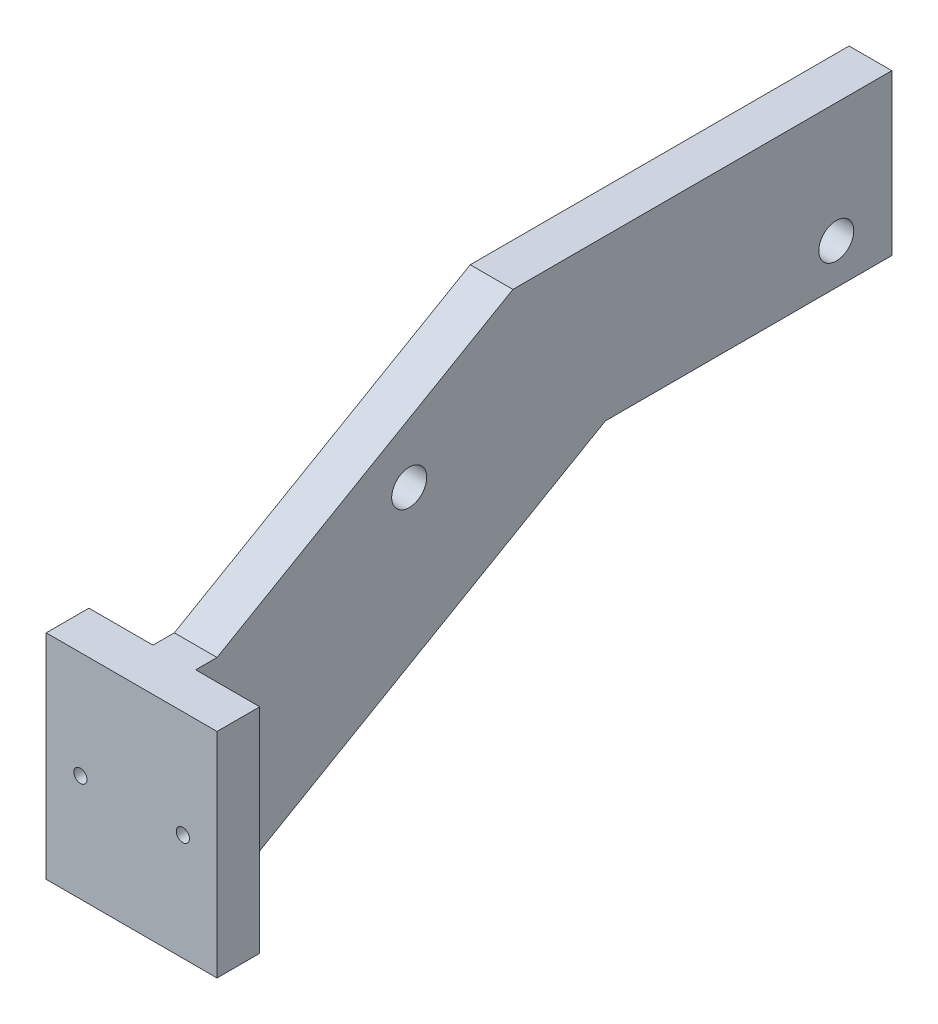
ISO-10303-21;
HEADER;
FILE_DESCRIPTION(('STEP AP214'),'2;1');
FILE_NAME('part.step','',(''),(''),'','','');
FILE_SCHEMA(('AUTOMOTIVE_DESIGN { 1 0 10303 214 1 1 1 1 }'));
ENDSEC;
DATA;
#1=APPLICATION_CONTEXT('core data for automotive mechanical design processes');
#2=APPLICATION_PROTOCOL_DEFINITION('international standard','automotive_design',2000,#1);
#3=PRODUCT_CONTEXT('',#1,'mechanical');
#4=PRODUCT('Part','Part','',(#3));
#5=PRODUCT_RELATED_PRODUCT_CATEGORY('part','',(#4));
#6=PRODUCT_DEFINITION_FORMATION('','',#4);
#7=PRODUCT_DEFINITION_CONTEXT('part definition',#1,'design');
#8=PRODUCT_DEFINITION('design','',#6,#7);
#9=PRODUCT_DEFINITION_SHAPE('','',#8);
#10=(LENGTH_UNIT() NAMED_UNIT(*) SI_UNIT(.MILLI.,.METRE.));
#11=(NAMED_UNIT(*) PLANE_ANGLE_UNIT() SI_UNIT($,.RADIAN.));
#12=(NAMED_UNIT(*) SI_UNIT($,.STERADIAN.) SOLID_ANGLE_UNIT());
#13=UNCERTAINTY_MEASURE_WITH_UNIT(LENGTH_MEASURE(1.E-05),#10,'distance_accuracy_value','');
#14=(GEOMETRIC_REPRESENTATION_CONTEXT(3) GLOBAL_UNCERTAINTY_ASSIGNED_CONTEXT((#13)) GLOBAL_UNIT_ASSIGNED_CONTEXT((#10,
#11,#12)) REPRESENTATION_CONTEXT('',''));
#15=CARTESIAN_POINT('',(0.,0.,0.));
#16=DIRECTION('',(0.,0.,1.));
#17=DIRECTION('',(1.,0.,0.));
#18=AXIS2_PLACEMENT_3D('',#15,#16,#17);
#19=CARTESIAN_POINT('',(10.,0.,0.));
#20=DIRECTION('',(-1.,0.,0.));
#21=DIRECTION('',(0.,0.,1.));
#22=AXIS2_PLACEMENT_3D('',#19,#20,#21);
#23=PLANE('',#22);
#24=CARTESIAN_POINT('',(10.,62.,-160.));
#25=DIRECTION('',(1.,0.,0.));
#26=DIRECTION('',(0.,0.,-1.));
#27=AXIS2_PLACEMENT_3D('',#24,#25,#26);
#28=CIRCLE('',#27,4.09999999999998);
#29=CARTESIAN_POINT('',(10.,62.,-164.1));
#30=VERTEX_POINT('',#29);
#31=EDGE_CURVE('E301',#30,#30,#28,.T.);
#32=ORIENTED_EDGE('',*,*,#31,.F.);
#33=EDGE_LOOP('',(#32));
#34=FACE_BOUND('',#33,.T.);
#35=CARTESIAN_POINT('',(10.,62.,-60.));
#36=DIRECTION('',(1.,0.,0.));
#37=DIRECTION('',(0.,0.,-1.));
#38=AXIS2_PLACEMENT_3D('',#35,#36,#37);
#39=CIRCLE('',#38,4.1);
#40=CARTESIAN_POINT('',(10.,62.,-64.1));
#41=VERTEX_POINT('',#40);
#42=EDGE_CURVE('E303',#41,#41,#39,.T.);
#43=ORIENTED_EDGE('',*,*,#42,.F.);
#44=EDGE_LOOP('',(#43));
#45=FACE_BOUND('',#44,.T.);
#46=DIRECTION('',(0.,1.,0.));
#47=VECTOR('',#46,1.);
#48=CARTESIAN_POINT('',(10.,0.,-10.));
#49=LINE('',#48,#47);
#50=CARTESIAN_POINT('',(10.,0.,-10.));
#51=VERTEX_POINT('',#50);
#52=CARTESIAN_POINT('',(10.,50.,-10.));
#53=VERTEX_POINT('',#52);
#54=EDGE_CURVE('E52',#51,#53,#49,.T.);
#55=ORIENTED_EDGE('',*,*,#54,.F.);
#56=DIRECTION('',(0.,0.,-1.));
#57=VECTOR('',#56,1.);
#58=CARTESIAN_POINT('',(10.,0.,0.));
#59=LINE('',#58,#57);
#60=CARTESIAN_POINT('',(10.,0.,-15.));
#61=VERTEX_POINT('',#60);
#62=EDGE_CURVE('E168',#51,#61,#59,.T.);
#63=ORIENTED_EDGE('',*,*,#62,.T.);
#64=DIRECTION('',(0.,0.500000000000001,-0.866025403784438));
#65=VECTOR('',#64,1.);
#66=CARTESIAN_POINT('',(10.,0.,-15.));
#67=LINE('',#66,#65);
#68=CARTESIAN_POINT('',(10.,52.5000000000002,-105.932667397366));
#69=VERTEX_POINT('',#68);
#70=EDGE_CURVE('E170',#61,#69,#67,.T.);
#71=ORIENTED_EDGE('',*,*,#70,.T.);
#72=DIRECTION('',(0.,0.,-1.));
#73=VECTOR('',#72,1.);
#74=CARTESIAN_POINT('',(10.,52.5000000000002,-173.002060715528));
#75=LINE('',#74,#73);
#76=CARTESIAN_POINT('',(10.,52.5000000000002,-173.002060715528));
#77=VERTEX_POINT('',#76);
#78=EDGE_CURVE('E172',#69,#77,#75,.T.);
#79=ORIENTED_EDGE('',*,*,#78,.T.);
#80=DIRECTION('',(0.,1.,0.));
#81=VECTOR('',#80,1.);
#82=CARTESIAN_POINT('',(10.,90.0000000000001,-173.002060715528));
#83=LINE('',#82,#81);
#84=CARTESIAN_POINT('',(10.,90.0000000000001,-173.002060715528));
#85=VERTEX_POINT('',#84);
#86=EDGE_CURVE('E174',#77,#85,#83,.T.);
#87=ORIENTED_EDGE('',*,*,#86,.T.);
#88=DIRECTION('',(0.,0.,1.));
#89=VECTOR('',#88,1.);
#90=CARTESIAN_POINT('',(10.,90.0000000000001,-84.2820323027551));
#91=LINE('',#90,#89);
#92=CARTESIAN_POINT('',(10.,90.0000000000001,-84.2820323027551));
#93=VERTEX_POINT('',#92);
#94=EDGE_CURVE('E176',#85,#93,#91,.T.);
#95=ORIENTED_EDGE('',*,*,#94,.T.);
#96=DIRECTION('',(0.,-0.500000000000001,0.866025403784438));
#97=VECTOR('',#96,1.);
#98=CARTESIAN_POINT('',(10.,50.,-15.));
#99=LINE('',#98,#97);
#100=CARTESIAN_POINT('',(10.,50.,-15.));
#101=VERTEX_POINT('',#100);
#102=EDGE_CURVE('E178',#93,#101,#99,.T.);
#103=ORIENTED_EDGE('',*,*,#102,.T.);
#104=DIRECTION('',(0.,0.,1.));
#105=VECTOR('',#104,1.);
#106=CARTESIAN_POINT('',(10.,50.,0.));
#107=LINE('',#106,#105);
#108=EDGE_CURVE('E48',#101,#53,#107,.T.);
#109=ORIENTED_EDGE('',*,*,#108,.T.);
#110=EDGE_LOOP('',(#55,#63,#71,#79,#87,#95,#103,#109));
#111=FACE_BOUND('',#110,.T.);
#112=ADVANCED_FACE('F33',(#34,#45,#111),#23,.F.);
#113=CARTESIAN_POINT('',(0.,0.,0.));
#114=DIRECTION('',(-1.,0.,0.));
#115=DIRECTION('',(0.,0.,1.));
#116=AXIS2_PLACEMENT_3D('',#113,#114,#115);
#117=PLANE('',#116);
#118=CARTESIAN_POINT('',(0.,62.,-160.));
#119=DIRECTION('',(1.,0.,0.));
#120=DIRECTION('',(0.,0.,-1.));
#121=AXIS2_PLACEMENT_3D('',#118,#119,#120);
#122=CIRCLE('',#121,4.09999999999998);
#123=CARTESIAN_POINT('',(0.,62.,-164.1));
#124=VERTEX_POINT('',#123);
#125=EDGE_CURVE('E299',#124,#124,#122,.T.);
#126=ORIENTED_EDGE('',*,*,#125,.T.);
#127=EDGE_LOOP('',(#126));
#128=FACE_BOUND('',#127,.T.);
#129=CARTESIAN_POINT('',(0.,62.,-60.));
#130=DIRECTION('',(1.,0.,0.));
#131=DIRECTION('',(0.,0.,-1.));
#132=AXIS2_PLACEMENT_3D('',#129,#130,#131);
#133=CIRCLE('',#132,4.1);
#134=CARTESIAN_POINT('',(0.,62.,-64.1));
#135=VERTEX_POINT('',#134);
#136=EDGE_CURVE('E306',#135,#135,#133,.T.);
#137=ORIENTED_EDGE('',*,*,#136,.T.);
#138=EDGE_LOOP('',(#137));
#139=FACE_BOUND('',#138,.T.);
#140=DIRECTION('',(0.,0.,-1.));
#141=VECTOR('',#140,1.);
#142=CARTESIAN_POINT('',(0.,0.,0.));
#143=LINE('',#142,#141);
#144=CARTESIAN_POINT('',(0.,0.,-10.));
#145=VERTEX_POINT('',#144);
#146=CARTESIAN_POINT('',(0.,0.,-15.));
#147=VERTEX_POINT('',#146);
#148=EDGE_CURVE('E167',#145,#147,#143,.T.);
#149=ORIENTED_EDGE('',*,*,#148,.F.);
#150=DIRECTION('',(0.,1.,0.));
#151=VECTOR('',#150,1.);
#152=CARTESIAN_POINT('',(0.,0.,-10.));
#153=LINE('',#152,#151);
#154=CARTESIAN_POINT('',(0.,50.,-10.));
#155=VERTEX_POINT('',#154);
#156=EDGE_CURVE('E11',#145,#155,#153,.T.);
#157=ORIENTED_EDGE('',*,*,#156,.T.);
#158=DIRECTION('',(0.,0.,1.));
#159=VECTOR('',#158,1.);
#160=CARTESIAN_POINT('',(0.,50.,0.));
#161=LINE('',#160,#159);
#162=CARTESIAN_POINT('',(0.,50.,-15.));
#163=VERTEX_POINT('',#162);
#164=EDGE_CURVE('E127',#163,#155,#161,.T.);
#165=ORIENTED_EDGE('',*,*,#164,.F.);
#166=DIRECTION('',(0.,-0.500000000000001,0.866025403784438));
#167=VECTOR('',#166,1.);
#168=CARTESIAN_POINT('',(0.,50.,-15.));
#169=LINE('',#168,#167);
#170=CARTESIAN_POINT('',(0.,90.0000000000001,-84.2820323027551));
#171=VERTEX_POINT('',#170);
#172=EDGE_CURVE('E191',#171,#163,#169,.T.);
#173=ORIENTED_EDGE('',*,*,#172,.F.);
#174=DIRECTION('',(0.,0.,1.));
#175=VECTOR('',#174,1.);
#176=CARTESIAN_POINT('',(0.,90.0000000000001,-84.2820323027551));
#177=LINE('',#176,#175);
#178=CARTESIAN_POINT('',(0.,90.0000000000001,-173.002060715528));
#179=VERTEX_POINT('',#178);
#180=EDGE_CURVE('E189',#179,#171,#177,.T.);
#181=ORIENTED_EDGE('',*,*,#180,.F.);
#182=DIRECTION('',(0.,1.,0.));
#183=VECTOR('',#182,1.);
#184=CARTESIAN_POINT('',(0.,90.0000000000001,-173.002060715528));
#185=LINE('',#184,#183);
#186=CARTESIAN_POINT('',(0.,52.5000000000002,-173.002060715528));
#187=VERTEX_POINT('',#186);
#188=EDGE_CURVE('E187',#187,#179,#185,.T.);
#189=ORIENTED_EDGE('',*,*,#188,.F.);
#190=DIRECTION('',(0.,0.,-1.));
#191=VECTOR('',#190,1.);
#192=CARTESIAN_POINT('',(0.,52.5000000000002,-173.002060715528));
#193=LINE('',#192,#191);
#194=CARTESIAN_POINT('',(0.,52.5000000000002,-105.932667397366));
#195=VERTEX_POINT('',#194);
#196=EDGE_CURVE('E185',#195,#187,#193,.T.);
#197=ORIENTED_EDGE('',*,*,#196,.F.);
#198=DIRECTION('',(0.,0.500000000000001,-0.866025403784438));
#199=VECTOR('',#198,1.);
#200=CARTESIAN_POINT('',(0.,0.,-15.));
#201=LINE('',#200,#199);
#202=EDGE_CURVE('E183',#147,#195,#201,.T.);
#203=ORIENTED_EDGE('',*,*,#202,.F.);
#204=EDGE_LOOP('',(#149,#157,#165,#173,#181,#189,#197,#203));
#205=FACE_BOUND('',#204,.T.);
#206=ADVANCED_FACE('F222',(#128,#139,#205),#117,.T.);
#207=CARTESIAN_POINT('',(10.,0.,0.));
#208=DIRECTION('',(0.,1.,0.));
#209=DIRECTION('',(0.,0.,1.));
#210=AXIS2_PLACEMENT_3D('',#207,#208,#209);
#211=PLANE('',#210);
#212=DIRECTION('',(-1.,0.,0.));
#213=VECTOR('',#212,1.);
#214=CARTESIAN_POINT('',(10.,0.,0.));
#215=LINE('',#214,#213);
#216=CARTESIAN_POINT('',(25.,0.,0.));
#217=VERTEX_POINT('',#216);
#218=CARTESIAN_POINT('',(-15.,0.,0.));
#219=VERTEX_POINT('',#218);
#220=EDGE_CURVE('E181',#217,#219,#215,.T.);
#221=ORIENTED_EDGE('',*,*,#220,.T.);
#222=DIRECTION('',(0.,0.,1.));
#223=VECTOR('',#222,1.);
#224=CARTESIAN_POINT('',(-15.,0.,-10.));
#225=LINE('',#224,#223);
#226=CARTESIAN_POINT('',(-15.,0.,-10.));
#227=VERTEX_POINT('',#226);
#228=EDGE_CURVE('E140',#227,#219,#225,.T.);
#229=ORIENTED_EDGE('',*,*,#228,.F.);
#230=DIRECTION('',(1.,0.,0.));
#231=VECTOR('',#230,1.);
#232=CARTESIAN_POINT('',(-15.,0.,-10.));
#233=LINE('',#232,#231);
#234=EDGE_CURVE('E146',#227,#145,#233,.T.);
#235=ORIENTED_EDGE('',*,*,#234,.T.);
#236=ORIENTED_EDGE('',*,*,#148,.T.);
#237=DIRECTION('',(-1.,0.,0.));
#238=VECTOR('',#237,1.);
#239=CARTESIAN_POINT('',(10.,0.,-15.));
#240=LINE('',#239,#238);
#241=EDGE_CURVE('E41',#61,#147,#240,.T.);
#242=ORIENTED_EDGE('',*,*,#241,.F.);
#243=ORIENTED_EDGE('',*,*,#62,.F.);
#244=CARTESIAN_POINT('',(25.,0.,-10.));
#245=VERTEX_POINT('',#244);
#246=EDGE_CURVE('E147',#51,#245,#233,.T.);
#247=ORIENTED_EDGE('',*,*,#246,.T.);
#248=DIRECTION('',(0.,0.,1.));
#249=VECTOR('',#248,1.);
#250=CARTESIAN_POINT('',(25.,0.,-10.));
#251=LINE('',#250,#249);
#252=EDGE_CURVE('E162',#245,#217,#251,.T.);
#253=ORIENTED_EDGE('',*,*,#252,.T.);
#254=EDGE_LOOP('',(#221,#229,#235,#236,#242,#243,#247,#253));
#255=FACE_BOUND('',#254,.T.);
#256=ADVANCED_FACE('F35',(#255),#211,.F.);
#257=CARTESIAN_POINT('',(10.,0.,-15.));
#258=DIRECTION('',(0.,0.866025403784438,0.500000000000001));
#259=DIRECTION('',(0.,-0.500000000000001,0.866025403784438));
#260=AXIS2_PLACEMENT_3D('',#257,#258,#259);
#261=PLANE('',#260);
#262=ORIENTED_EDGE('',*,*,#202,.T.);
#263=DIRECTION('',(-1.,0.,0.));
#264=VECTOR('',#263,1.);
#265=CARTESIAN_POINT('',(10.,52.5000000000002,-105.932667397366));
#266=LINE('',#265,#264);
#267=EDGE_CURVE('E208',#69,#195,#266,.T.);
#268=ORIENTED_EDGE('',*,*,#267,.F.);
#269=ORIENTED_EDGE('',*,*,#70,.F.);
#270=ORIENTED_EDGE('',*,*,#241,.T.);
#271=EDGE_LOOP('',(#262,#268,#269,#270));
#272=FACE_BOUND('',#271,.T.);
#273=ADVANCED_FACE('F214',(#272),#261,.F.);
#274=CARTESIAN_POINT('',(10.,52.5000000000002,-173.002060715528));
#275=DIRECTION('',(0.,1.,0.));
#276=DIRECTION('',(0.,0.,1.));
#277=AXIS2_PLACEMENT_3D('',#274,#275,#276);
#278=PLANE('',#277);
#279=ORIENTED_EDGE('',*,*,#196,.T.);
#280=DIRECTION('',(-1.,0.,0.));
#281=VECTOR('',#280,1.);
#282=CARTESIAN_POINT('',(10.,52.5000000000002,-173.002060715528));
#283=LINE('',#282,#281);
#284=EDGE_CURVE('E205',#77,#187,#283,.T.);
#285=ORIENTED_EDGE('',*,*,#284,.F.);
#286=ORIENTED_EDGE('',*,*,#78,.F.);
#287=ORIENTED_EDGE('',*,*,#267,.T.);
#288=EDGE_LOOP('',(#279,#285,#286,#287));
#289=FACE_BOUND('',#288,.T.);
#290=ADVANCED_FACE('F227',(#289),#278,.F.);
#291=CARTESIAN_POINT('',(10.,90.0000000000001,-173.002060715528));
#292=DIRECTION('',(0.,0.,1.));
#293=DIRECTION('',(1.,0.,0.));
#294=AXIS2_PLACEMENT_3D('',#291,#292,#293);
#295=PLANE('',#294);
#296=ORIENTED_EDGE('',*,*,#188,.T.);
#297=DIRECTION('',(-1.,0.,0.));
#298=VECTOR('',#297,1.);
#299=CARTESIAN_POINT('',(10.,90.0000000000001,-173.002060715528));
#300=LINE('',#299,#298);
#301=EDGE_CURVE('E202',#85,#179,#300,.T.);
#302=ORIENTED_EDGE('',*,*,#301,.F.);
#303=ORIENTED_EDGE('',*,*,#86,.F.);
#304=ORIENTED_EDGE('',*,*,#284,.T.);
#305=EDGE_LOOP('',(#296,#302,#303,#304));
#306=FACE_BOUND('',#305,.T.);
#307=ADVANCED_FACE('F231',(#306),#295,.F.);
#308=CARTESIAN_POINT('',(10.,90.0000000000001,-84.2820323027551));
#309=DIRECTION('',(0.,-1.,0.));
#310=DIRECTION('',(0.,0.,-1.));
#311=AXIS2_PLACEMENT_3D('',#308,#309,#310);
#312=PLANE('',#311);
#313=ORIENTED_EDGE('',*,*,#180,.T.);
#314=DIRECTION('',(-1.,0.,0.));
#315=VECTOR('',#314,1.);
#316=CARTESIAN_POINT('',(10.,90.0000000000001,-84.2820323027551));
#317=LINE('',#316,#315);
#318=EDGE_CURVE('E199',#93,#171,#317,.T.);
#319=ORIENTED_EDGE('',*,*,#318,.F.);
#320=ORIENTED_EDGE('',*,*,#94,.F.);
#321=ORIENTED_EDGE('',*,*,#301,.T.);
#322=EDGE_LOOP('',(#313,#319,#320,#321));
#323=FACE_BOUND('',#322,.T.);
#324=ADVANCED_FACE('F238',(#323),#312,.F.);
#325=CARTESIAN_POINT('',(10.,50.,-15.));
#326=DIRECTION('',(0.,-0.866025403784438,-0.500000000000001));
#327=DIRECTION('',(0.,0.500000000000001,-0.866025403784438));
#328=AXIS2_PLACEMENT_3D('',#325,#326,#327);
#329=PLANE('',#328);
#330=ORIENTED_EDGE('',*,*,#172,.T.);
#331=DIRECTION('',(-1.,0.,0.));
#332=VECTOR('',#331,1.);
#333=CARTESIAN_POINT('',(10.,50.,-15.));
#334=LINE('',#333,#332);
#335=EDGE_CURVE('E197',#101,#163,#334,.T.);
#336=ORIENTED_EDGE('',*,*,#335,.F.);
#337=ORIENTED_EDGE('',*,*,#102,.F.);
#338=ORIENTED_EDGE('',*,*,#318,.T.);
#339=EDGE_LOOP('',(#330,#336,#337,#338));
#340=FACE_BOUND('',#339,.T.);
#341=ADVANCED_FACE('F241',(#340),#329,.F.);
#342=CARTESIAN_POINT('',(10.,50.,0.));
#343=DIRECTION('',(0.,-1.,0.));
#344=DIRECTION('',(0.,0.,-1.));
#345=AXIS2_PLACEMENT_3D('',#342,#343,#344);
#346=PLANE('',#345);
#347=DIRECTION('',(-1.,0.,0.));
#348=VECTOR('',#347,1.);
#349=CARTESIAN_POINT('',(10.,50.,0.));
#350=LINE('',#349,#348);
#351=CARTESIAN_POINT('',(25.,50.,0.));
#352=VERTEX_POINT('',#351);
#353=CARTESIAN_POINT('',(-15.,50.,0.));
#354=VERTEX_POINT('',#353);
#355=EDGE_CURVE('E195',#352,#354,#350,.T.);
#356=ORIENTED_EDGE('',*,*,#355,.F.);
#357=DIRECTION('',(0.,0.,1.));
#358=VECTOR('',#357,1.);
#359=CARTESIAN_POINT('',(25.,50.,-10.));
#360=LINE('',#359,#358);
#361=CARTESIAN_POINT('',(25.,50.,-10.));
#362=VERTEX_POINT('',#361);
#363=EDGE_CURVE('E159',#362,#352,#360,.T.);
#364=ORIENTED_EDGE('',*,*,#363,.F.);
#365=DIRECTION('',(-1.,0.,0.));
#366=VECTOR('',#365,1.);
#367=CARTESIAN_POINT('',(25.,50.,-10.));
#368=LINE('',#367,#366);
#369=EDGE_CURVE('E130',#362,#53,#368,.T.);
#370=ORIENTED_EDGE('',*,*,#369,.T.);
#371=ORIENTED_EDGE('',*,*,#108,.F.);
#372=ORIENTED_EDGE('',*,*,#335,.T.);
#373=ORIENTED_EDGE('',*,*,#164,.T.);
#374=CARTESIAN_POINT('',(-15.,50.,-10.));
#375=VERTEX_POINT('',#374);
#376=EDGE_CURVE('E120',#155,#375,#368,.T.);
#377=ORIENTED_EDGE('',*,*,#376,.T.);
#378=DIRECTION('',(0.,0.,1.));
#379=VECTOR('',#378,1.);
#380=CARTESIAN_POINT('',(-15.,50.,-10.));
#381=LINE('',#380,#379);
#382=EDGE_CURVE('E123',#375,#354,#381,.T.);
#383=ORIENTED_EDGE('',*,*,#382,.T.);
#384=EDGE_LOOP('',(#356,#364,#370,#371,#372,#373,#377,#383));
#385=FACE_BOUND('',#384,.T.);
#386=ADVANCED_FACE('F122',(#385),#346,.F.);
#387=CARTESIAN_POINT('',(10.,0.,0.));
#388=DIRECTION('',(0.,0.,-1.));
#389=DIRECTION('',(-1.,0.,0.));
#390=AXIS2_PLACEMENT_3D('',#387,#388,#389);
#391=PLANE('',#390);
#392=CARTESIAN_POINT('',(17.,25.,0.));
#393=DIRECTION('',(0.,0.,1.));
#394=DIRECTION('',(1.,0.,0.));
#395=AXIS2_PLACEMENT_3D('',#392,#393,#394);
#396=CIRCLE('',#395,1.55);
#397=CARTESIAN_POINT('',(18.55,25.,0.));
#398=VERTEX_POINT('',#397);
#399=EDGE_CURVE('E309',#398,#398,#396,.T.);
#400=ORIENTED_EDGE('',*,*,#399,.F.);
#401=EDGE_LOOP('',(#400));
#402=FACE_BOUND('',#401,.T.);
#403=CARTESIAN_POINT('',(-6.99999999999999,25.,0.));
#404=DIRECTION('',(0.,0.,1.));
#405=DIRECTION('',(1.,0.,0.));
#406=AXIS2_PLACEMENT_3D('',#403,#404,#405);
#407=CIRCLE('',#406,1.55);
#408=CARTESIAN_POINT('',(-5.44999999999999,25.,0.));
#409=VERTEX_POINT('',#408);
#410=EDGE_CURVE('E315',#409,#409,#407,.T.);
#411=ORIENTED_EDGE('',*,*,#410,.F.);
#412=EDGE_LOOP('',(#411));
#413=FACE_BOUND('',#412,.T.);
#414=ORIENTED_EDGE('',*,*,#355,.T.);
#415=DIRECTION('',(0.,-1.,0.));
#416=VECTOR('',#415,1.);
#417=CARTESIAN_POINT('',(-15.,50.,0.));
#418=LINE('',#417,#416);
#419=EDGE_CURVE('E139',#354,#219,#418,.T.);
#420=ORIENTED_EDGE('',*,*,#419,.T.);
#421=ORIENTED_EDGE('',*,*,#220,.F.);
#422=DIRECTION('',(0.,1.,0.));
#423=VECTOR('',#422,1.);
#424=CARTESIAN_POINT('',(25.,0.,0.));
#425=LINE('',#424,#423);
#426=EDGE_CURVE('E131',#217,#352,#425,.T.);
#427=ORIENTED_EDGE('',*,*,#426,.T.);
#428=EDGE_LOOP('',(#414,#420,#421,#427));
#429=FACE_BOUND('',#428,.T.);
#430=ADVANCED_FACE('F251',(#402,#413,#429),#391,.F.);
#431=CARTESIAN_POINT('',(-15.,50.,-10.));
#432=DIRECTION('',(-1.,0.,0.));
#433=DIRECTION('',(0.,-1.,0.));
#434=AXIS2_PLACEMENT_3D('',#431,#432,#433);
#435=PLANE('',#434);
#436=ORIENTED_EDGE('',*,*,#419,.F.);
#437=ORIENTED_EDGE('',*,*,#382,.F.);
#438=DIRECTION('',(0.,-1.,0.));
#439=VECTOR('',#438,1.);
#440=CARTESIAN_POINT('',(-15.,50.,-10.));
#441=LINE('',#440,#439);
#442=EDGE_CURVE('E137',#375,#227,#441,.T.);
#443=ORIENTED_EDGE('',*,*,#442,.T.);
#444=ORIENTED_EDGE('',*,*,#228,.T.);
#445=EDGE_LOOP('',(#436,#437,#443,#444));
#446=FACE_BOUND('',#445,.T.);
#447=ADVANCED_FACE('F135',(#446),#435,.T.);
#448=CARTESIAN_POINT('',(0.,0.,-10.));
#449=DIRECTION('',(0.,0.,1.));
#450=DIRECTION('',(1.,0.,0.));
#451=AXIS2_PLACEMENT_3D('',#448,#449,#450);
#452=PLANE('',#451);
#453=CARTESIAN_POINT('',(-6.99999999999999,25.,-10.));
#454=DIRECTION('',(0.,0.,1.));
#455=DIRECTION('',(1.,0.,0.));
#456=AXIS2_PLACEMENT_3D('',#453,#454,#455);
#457=CIRCLE('',#456,1.55);
#458=CARTESIAN_POINT('',(-5.44999999999999,25.,-10.));
#459=VERTEX_POINT('',#458);
#460=EDGE_CURVE('E156',#459,#459,#457,.T.);
#461=ORIENTED_EDGE('',*,*,#460,.T.);
#462=EDGE_LOOP('',(#461));
#463=FACE_BOUND('',#462,.T.);
#464=ORIENTED_EDGE('',*,*,#156,.F.);
#465=ORIENTED_EDGE('',*,*,#234,.F.);
#466=ORIENTED_EDGE('',*,*,#442,.F.);
#467=ORIENTED_EDGE('',*,*,#376,.F.);
#468=EDGE_LOOP('',(#464,#465,#466,#467));
#469=FACE_BOUND('',#468,.T.);
#470=ADVANCED_FACE('F144',(#463,#469),#452,.F.);
#471=CARTESIAN_POINT('',(17.,25.,-10.));
#472=DIRECTION('',(0.,0.,1.));
#473=DIRECTION('',(1.,0.,0.));
#474=AXIS2_PLACEMENT_3D('',#471,#472,#473);
#475=CIRCLE('',#474,1.55);
#476=CARTESIAN_POINT('',(18.55,25.,-10.));
#477=VERTEX_POINT('',#476);
#478=EDGE_CURVE('E312',#477,#477,#475,.T.);
#479=ORIENTED_EDGE('',*,*,#478,.T.);
#480=EDGE_LOOP('',(#479));
#481=FACE_BOUND('',#480,.T.);
#482=ORIENTED_EDGE('',*,*,#246,.F.);
#483=ORIENTED_EDGE('',*,*,#54,.T.);
#484=ORIENTED_EDGE('',*,*,#369,.F.);
#485=DIRECTION('',(0.,1.,0.));
#486=VECTOR('',#485,1.);
#487=CARTESIAN_POINT('',(25.,0.,-10.));
#488=LINE('',#487,#486);
#489=EDGE_CURVE('E141',#245,#362,#488,.T.);
#490=ORIENTED_EDGE('',*,*,#489,.F.);
#491=EDGE_LOOP('',(#482,#483,#484,#490));
#492=FACE_BOUND('',#491,.T.);
#493=ADVANCED_FACE('F245',(#481,#492),#452,.F.);
#494=CARTESIAN_POINT('',(25.,0.,-10.));
#495=DIRECTION('',(1.,0.,0.));
#496=DIRECTION('',(0.,0.,-1.));
#497=AXIS2_PLACEMENT_3D('',#494,#495,#496);
#498=PLANE('',#497);
#499=ORIENTED_EDGE('',*,*,#426,.F.);
#500=ORIENTED_EDGE('',*,*,#252,.F.);
#501=ORIENTED_EDGE('',*,*,#489,.T.);
#502=ORIENTED_EDGE('',*,*,#363,.T.);
#503=EDGE_LOOP('',(#499,#500,#501,#502));
#504=FACE_BOUND('',#503,.T.);
#505=ADVANCED_FACE('F249',(#504),#498,.T.);
#506=CARTESIAN_POINT('',(-6.99999999999999,25.,-10.));
#507=DIRECTION('',(0.,0.,1.));
#508=DIRECTION('',(1.,0.,0.));
#509=AXIS2_PLACEMENT_3D('',#506,#507,#508);
#510=CYLINDRICAL_SURFACE('',#509,1.55);
#511=ORIENTED_EDGE('',*,*,#460,.F.);
#512=EDGE_LOOP('',(#511));
#513=FACE_BOUND('',#512,.T.);
#514=ORIENTED_EDGE('',*,*,#410,.T.);
#515=EDGE_LOOP('',(#514));
#516=FACE_BOUND('',#515,.T.);
#517=ADVANCED_FACE('F276',(#513,#516),#510,.F.);
#518=CARTESIAN_POINT('',(17.,25.,-10.));
#519=DIRECTION('',(0.,0.,1.));
#520=DIRECTION('',(1.,0.,0.));
#521=AXIS2_PLACEMENT_3D('',#518,#519,#520);
#522=CYLINDRICAL_SURFACE('',#521,1.55);
#523=ORIENTED_EDGE('',*,*,#478,.F.);
#524=EDGE_LOOP('',(#523));
#525=FACE_BOUND('',#524,.T.);
#526=ORIENTED_EDGE('',*,*,#399,.T.);
#527=EDGE_LOOP('',(#526));
#528=FACE_BOUND('',#527,.T.);
#529=ADVANCED_FACE('F282',(#525,#528),#522,.F.);
#530=CARTESIAN_POINT('',(0.,62.,-60.));
#531=DIRECTION('',(1.,0.,0.));
#532=DIRECTION('',(0.,0.,-1.));
#533=AXIS2_PLACEMENT_3D('',#530,#531,#532);
#534=CYLINDRICAL_SURFACE('',#533,4.1);
#535=ORIENTED_EDGE('',*,*,#136,.F.);
#536=EDGE_LOOP('',(#535));
#537=FACE_BOUND('',#536,.T.);
#538=ORIENTED_EDGE('',*,*,#42,.T.);
#539=EDGE_LOOP('',(#538));
#540=FACE_BOUND('',#539,.T.);
#541=ADVANCED_FACE('F286',(#537,#540),#534,.F.);
#542=CARTESIAN_POINT('',(0.,62.,-160.));
#543=DIRECTION('',(1.,0.,0.));
#544=DIRECTION('',(0.,0.,-1.));
#545=AXIS2_PLACEMENT_3D('',#542,#543,#544);
#546=CYLINDRICAL_SURFACE('',#545,4.09999999999998);
#547=ORIENTED_EDGE('',*,*,#125,.F.);
#548=EDGE_LOOP('',(#547));
#549=FACE_BOUND('',#548,.T.);
#550=ORIENTED_EDGE('',*,*,#31,.T.);
#551=EDGE_LOOP('',(#550));
#552=FACE_BOUND('',#551,.T.);
#553=ADVANCED_FACE('F290',(#549,#552),#546,.F.);
#554=CLOSED_SHELL('',(#112,#206,#256,#273,#290,#307,#324,#341,#386,#430,#447,#470,#493,#505,
#517,#529,#541,#553));
#555=MANIFOLD_SOLID_BREP('B2',#554);
#556=ADVANCED_BREP_SHAPE_REPRESENTATION('',(#18,#555),#14);
#557=SHAPE_DEFINITION_REPRESENTATION(#9,#556);
ENDSEC;
END-ISO-10303-21;
